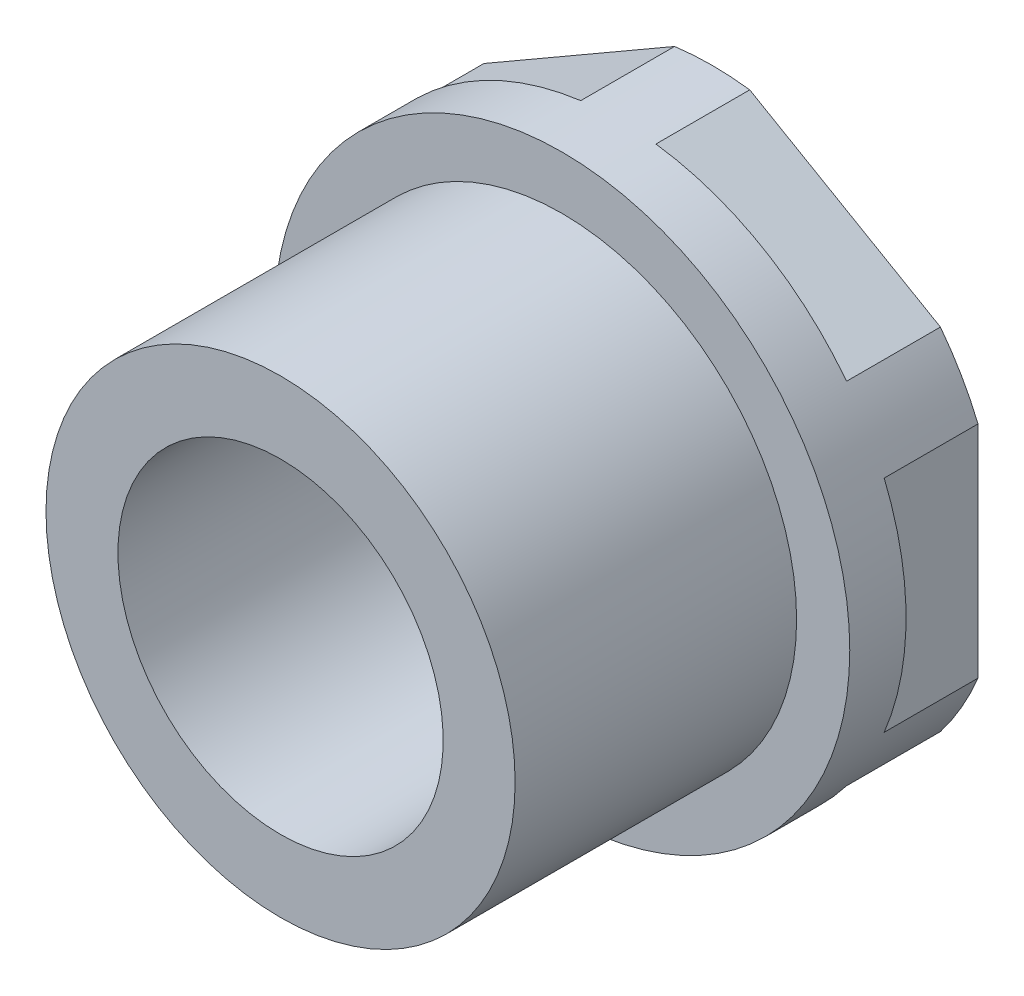
ISO-10303-21;
HEADER;
FILE_DESCRIPTION(('STEP AP214'),'2;1');
FILE_NAME('part.step','',(''),(''),'','','');
FILE_SCHEMA(('AUTOMOTIVE_DESIGN { 1 0 10303 214 1 1 1 1 }'));
ENDSEC;
DATA;
#1=APPLICATION_CONTEXT('core data for automotive mechanical design processes');
#2=APPLICATION_PROTOCOL_DEFINITION('international standard','automotive_design',2000,#1);
#3=PRODUCT_CONTEXT('',#1,'mechanical');
#4=PRODUCT('Part','Part','',(#3));
#5=PRODUCT_RELATED_PRODUCT_CATEGORY('part','',(#4));
#6=PRODUCT_DEFINITION_FORMATION('','',#4);
#7=PRODUCT_DEFINITION_CONTEXT('part definition',#1,'design');
#8=PRODUCT_DEFINITION('design','',#6,#7);
#9=PRODUCT_DEFINITION_SHAPE('','',#8);
#10=(LENGTH_UNIT() NAMED_UNIT(*) SI_UNIT(.MILLI.,.METRE.));
#11=(NAMED_UNIT(*) PLANE_ANGLE_UNIT() SI_UNIT($,.RADIAN.));
#12=(NAMED_UNIT(*) SI_UNIT($,.STERADIAN.) SOLID_ANGLE_UNIT());
#13=UNCERTAINTY_MEASURE_WITH_UNIT(LENGTH_MEASURE(1.E-05),#10,'distance_accuracy_value','');
#14=(GEOMETRIC_REPRESENTATION_CONTEXT(3) GLOBAL_UNCERTAINTY_ASSIGNED_CONTEXT((#13)) GLOBAL_UNIT_ASSIGNED_CONTEXT((#10,
#11,#12)) REPRESENTATION_CONTEXT('',''));
#15=CARTESIAN_POINT('',(0.,0.,0.));
#16=DIRECTION('',(0.,0.,1.));
#17=DIRECTION('',(1.,0.,0.));
#18=AXIS2_PLACEMENT_3D('',#15,#16,#17);
#19=CARTESIAN_POINT('',(-5.86105340387706,40.6504195270786,51.5));
#20=DIRECTION('',(0.,0.,-1.));
#21=DIRECTION('',(-1.,0.,0.));
#22=AXIS2_PLACEMENT_3D('',#19,#20,#21);
#23=PLANE('',#22);
#24=CARTESIAN_POINT('',(-5.86105340387706,40.6504195270786,51.5));
#25=DIRECTION('',(0.,0.,1.));
#26=DIRECTION('',(0.,-1.,0.));
#27=AXIS2_PLACEMENT_3D('',#24,#25,#26);
#28=CIRCLE('',#27,9.2);
#29=CARTESIAN_POINT('',(1.43730681105818,46.2516638685665,51.5));
#30=VERTEX_POINT('',#29);
#31=CARTESIAN_POINT('',(-4.65941361881229,49.7716070499261,51.5));
#32=VERTEX_POINT('',#31);
#33=EDGE_CURVE('E126',#30,#32,#28,.T.);
#34=ORIENTED_EDGE('',*,*,#33,.F.);
#35=DIRECTION('',(0.866025403784439,-0.5,0.));
#36=VECTOR('',#35,1.);
#37=CARTESIAN_POINT('',(-4.65941361881229,49.7716070499261,51.5));
#38=LINE('',#37,#36);
#39=EDGE_CURVE('E122',#30,#32,#38,.F.);
#40=ORIENTED_EDGE('',*,*,#39,.T.);
#41=EDGE_LOOP('',(#34,#40));
#42=FACE_BOUND('',#41,.T.);
#43=ADVANCED_FACE('F18',(#42),#23,.T.);
#44=CARTESIAN_POINT('',(-4.65941361881229,49.7716070499261,51.5));
#45=DIRECTION('',(-0.5,-0.866025403784439,0.));
#46=DIRECTION('',(0.866025403784439,-0.5,0.));
#47=AXIS2_PLACEMENT_3D('',#44,#45,#46);
#48=PLANE('',#47);
#49=ORIENTED_EDGE('',*,*,#39,.F.);
#50=DIRECTION('',(0.,0.,1.));
#51=VECTOR('',#50,1.);
#52=CARTESIAN_POINT('',(1.43730681105818,46.2516638685665,53.3));
#53=LINE('',#52,#51);
#54=CARTESIAN_POINT('',(1.43730681105818,46.2516638685665,48.5));
#55=VERTEX_POINT('',#54);
#56=EDGE_CURVE('E120',#55,#30,#53,.T.);
#57=ORIENTED_EDGE('',*,*,#56,.F.);
#58=DIRECTION('',(0.866025403784438,-0.5,0.));
#59=VECTOR('',#58,1.);
#60=CARTESIAN_POINT('',(-4.65941361881229,49.7716070499261,48.5));
#61=LINE('',#60,#59);
#62=CARTESIAN_POINT('',(-4.65941361881229,49.7716070499261,48.5));
#63=VERTEX_POINT('',#62);
#64=EDGE_CURVE('E105',#63,#55,#61,.T.);
#65=ORIENTED_EDGE('',*,*,#64,.F.);
#66=DIRECTION('',(0.,0.,1.));
#67=VECTOR('',#66,1.);
#68=CARTESIAN_POINT('',(-4.65941361881229,49.7716070499261,53.3));
#69=LINE('',#68,#67);
#70=EDGE_CURVE('E136',#32,#63,#69,.F.);
#71=ORIENTED_EDGE('',*,*,#70,.F.);
#72=EDGE_LOOP('',(#49,#57,#65,#71));
#73=FACE_BOUND('',#72,.T.);
#74=ADVANCED_FACE('F121',(#73),#48,.F.);
#75=CARTESIAN_POINT('',(-5.86105340387706,40.6504195270786,51.5));
#76=DIRECTION('',(0.,0.,-1.));
#77=DIRECTION('',(-1.,0.,0.));
#78=AXIS2_PLACEMENT_3D('',#75,#76,#77);
#79=PLANE('',#78);
#80=CARTESIAN_POINT('',(-5.86105340387706,40.6504195270786,51.5));
#81=DIRECTION('',(0.,0.,1.));
#82=DIRECTION('',(0.,-1.,0.));
#83=AXIS2_PLACEMENT_3D('',#80,#81,#82);
#84=CIRCLE('',#83,9.2);
#85=CARTESIAN_POINT('',(-7.06269318894182,49.7716070499261,51.5));
#86=VERTEX_POINT('',#85);
#87=CARTESIAN_POINT('',(-13.1594136188123,46.2516638685665,51.5));
#88=VERTEX_POINT('',#87);
#89=EDGE_CURVE('E139',#86,#88,#84,.T.);
#90=ORIENTED_EDGE('',*,*,#89,.F.);
#91=DIRECTION('',(0.866025403784439,0.5,0.));
#92=VECTOR('',#91,1.);
#93=CARTESIAN_POINT('',(-13.1594136188123,46.2516638685665,51.5));
#94=LINE('',#93,#92);
#95=EDGE_CURVE('E183',#86,#88,#94,.F.);
#96=ORIENTED_EDGE('',*,*,#95,.T.);
#97=EDGE_LOOP('',(#90,#96));
#98=FACE_BOUND('',#97,.T.);
#99=ADVANCED_FACE('F337',(#98),#79,.T.);
#100=CARTESIAN_POINT('',(-13.1594136188123,46.2516638685665,51.5));
#101=DIRECTION('',(0.5,-0.866025403784439,0.));
#102=DIRECTION('',(0.866025403784439,0.5,0.));
#103=AXIS2_PLACEMENT_3D('',#100,#101,#102);
#104=PLANE('',#103);
#105=ORIENTED_EDGE('',*,*,#95,.F.);
#106=DIRECTION('',(0.,0.,1.));
#107=VECTOR('',#106,1.);
#108=CARTESIAN_POINT('',(-7.06269318894182,49.7716070499261,53.3));
#109=LINE('',#108,#107);
#110=CARTESIAN_POINT('',(-7.06269318894182,49.7716070499261,48.5));
#111=VERTEX_POINT('',#110);
#112=EDGE_CURVE('E138',#111,#86,#109,.T.);
#113=ORIENTED_EDGE('',*,*,#112,.F.);
#114=DIRECTION('',(0.866025403784439,0.5,0.));
#115=VECTOR('',#114,1.);
#116=CARTESIAN_POINT('',(-13.1594136188123,46.2516638685665,48.5));
#117=LINE('',#116,#115);
#118=CARTESIAN_POINT('',(-13.1594136188123,46.2516638685665,48.5));
#119=VERTEX_POINT('',#118);
#120=EDGE_CURVE('E117',#119,#111,#117,.T.);
#121=ORIENTED_EDGE('',*,*,#120,.F.);
#122=DIRECTION('',(0.,0.,1.));
#123=VECTOR('',#122,1.);
#124=CARTESIAN_POINT('',(-13.1594136188123,46.2516638685665,53.3));
#125=LINE('',#124,#123);
#126=EDGE_CURVE('E142',#88,#119,#125,.F.);
#127=ORIENTED_EDGE('',*,*,#126,.F.);
#128=EDGE_LOOP('',(#105,#113,#121,#127));
#129=FACE_BOUND('',#128,.T.);
#130=ADVANCED_FACE('F329',(#129),#104,.F.);
#131=CARTESIAN_POINT('',(-5.86105340387706,40.6504195270786,51.5));
#132=DIRECTION('',(0.,0.,-1.));
#133=DIRECTION('',(-1.,0.,0.));
#134=AXIS2_PLACEMENT_3D('',#131,#132,#133);
#135=PLANE('',#134);
#136=DIRECTION('',(0.,1.,0.));
#137=VECTOR('',#136,1.);
#138=CARTESIAN_POINT('',(-14.3610534038771,37.130476345719,51.5));
#139=LINE('',#138,#137);
#140=CARTESIAN_POINT('',(-14.3610534038771,44.1703627084382,51.5));
#141=VERTEX_POINT('',#140);
#142=CARTESIAN_POINT('',(-14.3610534038771,37.130476345719,51.5));
#143=VERTEX_POINT('',#142);
#144=EDGE_CURVE('E188',#141,#143,#139,.F.);
#145=ORIENTED_EDGE('',*,*,#144,.T.);
#146=CARTESIAN_POINT('',(-5.86105340387706,40.6504195270786,51.5));
#147=DIRECTION('',(0.,0.,1.));
#148=DIRECTION('',(0.,-1.,0.));
#149=AXIS2_PLACEMENT_3D('',#146,#147,#148);
#150=CIRCLE('',#149,9.2);
#151=EDGE_CURVE('E147',#141,#143,#150,.T.);
#152=ORIENTED_EDGE('',*,*,#151,.F.);
#153=EDGE_LOOP('',(#145,#152));
#154=FACE_BOUND('',#153,.T.);
#155=ADVANCED_FACE('F324',(#154),#135,.T.);
#156=CARTESIAN_POINT('',(-14.3610534038771,37.130476345719,51.5));
#157=DIRECTION('',(1.,0.,0.));
#158=DIRECTION('',(0.,1.,0.));
#159=AXIS2_PLACEMENT_3D('',#156,#157,#158);
#160=PLANE('',#159);
#161=ORIENTED_EDGE('',*,*,#144,.F.);
#162=DIRECTION('',(0.,0.,1.));
#163=VECTOR('',#162,1.);
#164=CARTESIAN_POINT('',(-14.3610534038771,44.1703627084382,53.3));
#165=LINE('',#164,#163);
#166=CARTESIAN_POINT('',(-14.3610534038771,44.1703627084382,48.5));
#167=VERTEX_POINT('',#166);
#168=EDGE_CURVE('E146',#167,#141,#165,.T.);
#169=ORIENTED_EDGE('',*,*,#168,.F.);
#170=DIRECTION('',(0.,1.,0.));
#171=VECTOR('',#170,1.);
#172=CARTESIAN_POINT('',(-14.3610534038771,40.6504195270786,48.5));
#173=LINE('',#172,#171);
#174=CARTESIAN_POINT('',(-14.3610534038771,37.130476345719,48.5));
#175=VERTEX_POINT('',#174);
#176=EDGE_CURVE('E211',#175,#167,#173,.T.);
#177=ORIENTED_EDGE('',*,*,#176,.F.);
#178=DIRECTION('',(0.,0.,1.));
#179=VECTOR('',#178,1.);
#180=CARTESIAN_POINT('',(-14.3610534038771,37.130476345719,53.3));
#181=LINE('',#180,#179);
#182=EDGE_CURVE('E150',#143,#175,#181,.F.);
#183=ORIENTED_EDGE('',*,*,#182,.F.);
#184=EDGE_LOOP('',(#161,#169,#177,#183));
#185=FACE_BOUND('',#184,.T.);
#186=ADVANCED_FACE('F316',(#185),#160,.F.);
#187=CARTESIAN_POINT('',(-5.86105340387706,40.6504195270786,51.5));
#188=DIRECTION('',(0.,0.,-1.));
#189=DIRECTION('',(-1.,0.,0.));
#190=AXIS2_PLACEMENT_3D('',#187,#188,#189);
#191=PLANE('',#190);
#192=CARTESIAN_POINT('',(-5.86105340387706,40.6504195270786,51.5));
#193=DIRECTION('',(0.,0.,1.));
#194=DIRECTION('',(0.,-1.,0.));
#195=AXIS2_PLACEMENT_3D('',#192,#193,#194);
#196=CIRCLE('',#195,9.2);
#197=CARTESIAN_POINT('',(-13.1594136188123,35.0491751855907,51.5));
#198=VERTEX_POINT('',#197);
#199=CARTESIAN_POINT('',(-7.06269318894182,31.529232004231,51.5));
#200=VERTEX_POINT('',#199);
#201=EDGE_CURVE('E155',#198,#200,#196,.T.);
#202=ORIENTED_EDGE('',*,*,#201,.F.);
#203=DIRECTION('',(-0.866025403784439,0.5,0.));
#204=VECTOR('',#203,1.);
#205=CARTESIAN_POINT('',(-7.06269318894183,31.529232004231,51.5));
#206=LINE('',#205,#204);
#207=EDGE_CURVE('E193',#198,#200,#206,.F.);
#208=ORIENTED_EDGE('',*,*,#207,.T.);
#209=EDGE_LOOP('',(#202,#208));
#210=FACE_BOUND('',#209,.T.);
#211=ADVANCED_FACE('F311',(#210),#191,.T.);
#212=CARTESIAN_POINT('',(-7.06269318894183,31.529232004231,51.5));
#213=DIRECTION('',(0.5,0.866025403784439,0.));
#214=DIRECTION('',(-0.866025403784439,0.5,0.));
#215=AXIS2_PLACEMENT_3D('',#212,#213,#214);
#216=PLANE('',#215);
#217=ORIENTED_EDGE('',*,*,#207,.F.);
#218=DIRECTION('',(0.,0.,1.));
#219=VECTOR('',#218,1.);
#220=CARTESIAN_POINT('',(-13.1594136188123,35.0491751855906,53.3));
#221=LINE('',#220,#219);
#222=CARTESIAN_POINT('',(-13.1594136188123,35.0491751855906,48.5));
#223=VERTEX_POINT('',#222);
#224=EDGE_CURVE('E154',#223,#198,#221,.T.);
#225=ORIENTED_EDGE('',*,*,#224,.F.);
#226=DIRECTION('',(-0.866025403784439,0.499999999999999,0.));
#227=VECTOR('',#226,1.);
#228=CARTESIAN_POINT('',(-7.06269318894182,31.529232004231,48.5));
#229=LINE('',#228,#227);
#230=CARTESIAN_POINT('',(-7.06269318894182,31.529232004231,48.5));
#231=VERTEX_POINT('',#230);
#232=EDGE_CURVE('E209',#231,#223,#229,.T.);
#233=ORIENTED_EDGE('',*,*,#232,.F.);
#234=DIRECTION('',(0.,0.,1.));
#235=VECTOR('',#234,1.);
#236=CARTESIAN_POINT('',(-7.06269318894182,31.529232004231,53.3));
#237=LINE('',#236,#235);
#238=EDGE_CURVE('E158',#200,#231,#237,.F.);
#239=ORIENTED_EDGE('',*,*,#238,.F.);
#240=EDGE_LOOP('',(#217,#225,#233,#239));
#241=FACE_BOUND('',#240,.T.);
#242=ADVANCED_FACE('F301',(#241),#216,.F.);
#243=CARTESIAN_POINT('',(-5.86105340387706,40.6504195270786,51.5));
#244=DIRECTION('',(0.,0.,-1.));
#245=DIRECTION('',(-1.,0.,0.));
#246=AXIS2_PLACEMENT_3D('',#243,#244,#245);
#247=PLANE('',#246);
#248=CARTESIAN_POINT('',(-5.86105340387706,40.6504195270786,51.5));
#249=DIRECTION('',(0.,0.,1.));
#250=DIRECTION('',(0.,-1.,0.));
#251=AXIS2_PLACEMENT_3D('',#248,#249,#250);
#252=CIRCLE('',#251,9.2);
#253=CARTESIAN_POINT('',(-4.65941361881228,31.529232004231,51.5));
#254=VERTEX_POINT('',#253);
#255=CARTESIAN_POINT('',(1.43730681105818,35.0491751855906,51.5));
#256=VERTEX_POINT('',#255);
#257=EDGE_CURVE('E163',#254,#256,#252,.T.);
#258=ORIENTED_EDGE('',*,*,#257,.F.);
#259=DIRECTION('',(-0.866025403784438,-0.500000000000001,0.));
#260=VECTOR('',#259,1.);
#261=CARTESIAN_POINT('',(1.43730681105818,35.0491751855906,51.5));
#262=LINE('',#261,#260);
#263=EDGE_CURVE('E199',#254,#256,#262,.F.);
#264=ORIENTED_EDGE('',*,*,#263,.T.);
#265=EDGE_LOOP('',(#258,#264));
#266=FACE_BOUND('',#265,.T.);
#267=ADVANCED_FACE('F295',(#266),#247,.T.);
#268=CARTESIAN_POINT('',(1.43730681105818,35.0491751855906,51.5));
#269=DIRECTION('',(-0.500000000000001,0.866025403784438,0.));
#270=DIRECTION('',(-0.866025403784438,-0.500000000000001,0.));
#271=AXIS2_PLACEMENT_3D('',#268,#269,#270);
#272=PLANE('',#271);
#273=ORIENTED_EDGE('',*,*,#263,.F.);
#274=DIRECTION('',(0.,0.,1.));
#275=VECTOR('',#274,1.);
#276=CARTESIAN_POINT('',(-4.65941361881228,31.529232004231,53.3));
#277=LINE('',#276,#275);
#278=CARTESIAN_POINT('',(-4.65941361881229,31.529232004231,48.5));
#279=VERTEX_POINT('',#278);
#280=EDGE_CURVE('E162',#279,#254,#277,.T.);
#281=ORIENTED_EDGE('',*,*,#280,.F.);
#282=DIRECTION('',(-0.866025403784438,-0.5,0.));
#283=VECTOR('',#282,1.);
#284=CARTESIAN_POINT('',(1.43730681105818,35.0491751855906,48.5));
#285=LINE('',#284,#283);
#286=CARTESIAN_POINT('',(1.43730681105818,35.0491751855906,48.5));
#287=VERTEX_POINT('',#286);
#288=EDGE_CURVE('E205',#287,#279,#285,.T.);
#289=ORIENTED_EDGE('',*,*,#288,.F.);
#290=DIRECTION('',(0.,0.,1.));
#291=VECTOR('',#290,1.);
#292=CARTESIAN_POINT('',(1.43730681105818,35.0491751855906,53.3));
#293=LINE('',#292,#291);
#294=EDGE_CURVE('E166',#256,#287,#293,.F.);
#295=ORIENTED_EDGE('',*,*,#294,.F.);
#296=EDGE_LOOP('',(#273,#281,#289,#295));
#297=FACE_BOUND('',#296,.T.);
#298=ADVANCED_FACE('F300',(#297),#272,.F.);
#299=CARTESIAN_POINT('',(-5.86105340387706,40.6504195270786,48.5));
#300=DIRECTION('',(0.,0.,-1.));
#301=DIRECTION('',(-1.,0.,0.));
#302=AXIS2_PLACEMENT_3D('',#299,#300,#301);
#303=PLANE('',#302);
#304=CARTESIAN_POINT('',(-5.86105340387706,40.6504195270786,48.4999999999332));
#305=DIRECTION('',(0.,0.,-1.));
#306=DIRECTION('',(0.,1.,0.));
#307=AXIS2_PLACEMENT_3D('',#304,#305,#306);
#308=CIRCLE('',#307,6.19999999994332);
#309=CARTESIAN_POINT('',(-5.86105340387706,46.8504195270219,48.4999999999332));
#310=VERTEX_POINT('',#309);
#311=EDGE_CURVE('E21',#310,#310,#308,.F.);
#312=ORIENTED_EDGE('',*,*,#311,.T.);
#313=EDGE_LOOP('',(#312));
#314=FACE_BOUND('',#313,.T.);
#315=ORIENTED_EDGE('',*,*,#64,.T.);
#316=CARTESIAN_POINT('',(-5.86105340387706,40.6504195270786,48.5));
#317=DIRECTION('',(0.,0.,1.));
#318=DIRECTION('',(0.,-1.,0.));
#319=AXIS2_PLACEMENT_3D('',#316,#317,#318);
#320=CIRCLE('',#319,9.2);
#321=CARTESIAN_POINT('',(2.63894659612294,44.1703627084382,48.5));
#322=VERTEX_POINT('',#321);
#323=EDGE_CURVE('E109',#322,#55,#320,.T.);
#324=ORIENTED_EDGE('',*,*,#323,.F.);
#325=DIRECTION('',(0.,-1.,0.));
#326=VECTOR('',#325,1.);
#327=CARTESIAN_POINT('',(2.63894659612294,44.1703627084382,48.5));
#328=LINE('',#327,#326);
#329=CARTESIAN_POINT('',(2.63894659612294,37.130476345719,48.5));
#330=VERTEX_POINT('',#329);
#331=EDGE_CURVE('E116',#322,#330,#328,.T.);
#332=ORIENTED_EDGE('',*,*,#331,.T.);
#333=CARTESIAN_POINT('',(-5.86105340387706,40.6504195270786,48.5));
#334=DIRECTION('',(0.,0.,1.));
#335=DIRECTION('',(0.,-1.,0.));
#336=AXIS2_PLACEMENT_3D('',#333,#334,#335);
#337=CIRCLE('',#336,9.2);
#338=EDGE_CURVE('E167',#287,#330,#337,.T.);
#339=ORIENTED_EDGE('',*,*,#338,.F.);
#340=ORIENTED_EDGE('',*,*,#288,.T.);
#341=CARTESIAN_POINT('',(-5.86105340387706,40.6504195270786,48.5));
#342=DIRECTION('',(0.,0.,1.));
#343=DIRECTION('',(0.,-1.,0.));
#344=AXIS2_PLACEMENT_3D('',#341,#342,#343);
#345=CIRCLE('',#344,9.2);
#346=EDGE_CURVE('E159',#231,#279,#345,.T.);
#347=ORIENTED_EDGE('',*,*,#346,.F.);
#348=ORIENTED_EDGE('',*,*,#232,.T.);
#349=CARTESIAN_POINT('',(-5.86105340387706,40.6504195270786,48.5));
#350=DIRECTION('',(0.,0.,1.));
#351=DIRECTION('',(0.,-1.,0.));
#352=AXIS2_PLACEMENT_3D('',#349,#350,#351);
#353=CIRCLE('',#352,9.2);
#354=EDGE_CURVE('E151',#175,#223,#353,.T.);
#355=ORIENTED_EDGE('',*,*,#354,.F.);
#356=ORIENTED_EDGE('',*,*,#176,.T.);
#357=CARTESIAN_POINT('',(-5.86105340387706,40.6504195270786,48.5));
#358=DIRECTION('',(0.,0.,1.));
#359=DIRECTION('',(0.,-1.,0.));
#360=AXIS2_PLACEMENT_3D('',#357,#358,#359);
#361=CIRCLE('',#360,9.2);
#362=EDGE_CURVE('E143',#119,#167,#361,.T.);
#363=ORIENTED_EDGE('',*,*,#362,.F.);
#364=ORIENTED_EDGE('',*,*,#120,.T.);
#365=CARTESIAN_POINT('',(-5.86105340387706,40.6504195270786,48.5));
#366=DIRECTION('',(0.,0.,1.));
#367=DIRECTION('',(0.,-1.,0.));
#368=AXIS2_PLACEMENT_3D('',#365,#366,#367);
#369=CIRCLE('',#368,9.2);
#370=EDGE_CURVE('E112',#63,#111,#369,.T.);
#371=ORIENTED_EDGE('',*,*,#370,.F.);
#372=EDGE_LOOP('',(#315,#324,#332,#339,#340,#347,#348,#355,#356,#363,#364,#371));
#373=FACE_BOUND('',#372,.T.);
#374=ADVANCED_FACE('F107',(#314,#373),#303,.T.);
#375=CARTESIAN_POINT('',(2.63894659612294,44.1703627084382,51.5));
#376=DIRECTION('',(-1.,0.,0.));
#377=DIRECTION('',(0.,-1.,0.));
#378=AXIS2_PLACEMENT_3D('',#375,#376,#377);
#379=PLANE('',#378);
#380=DIRECTION('',(0.,1.,0.));
#381=VECTOR('',#380,1.);
#382=CARTESIAN_POINT('',(2.63894659612295,40.6504195270786,51.5));
#383=LINE('',#382,#381);
#384=CARTESIAN_POINT('',(2.63894659612295,37.130476345719,51.5));
#385=VERTEX_POINT('',#384);
#386=CARTESIAN_POINT('',(2.63894659612294,44.1703627084382,51.5));
#387=VERTEX_POINT('',#386);
#388=EDGE_CURVE('E36',#385,#387,#383,.T.);
#389=ORIENTED_EDGE('',*,*,#388,.F.);
#390=DIRECTION('',(0.,0.,1.));
#391=VECTOR('',#390,1.);
#392=CARTESIAN_POINT('',(2.63894659612295,37.130476345719,53.3));
#393=LINE('',#392,#391);
#394=EDGE_CURVE('E170',#330,#385,#393,.T.);
#395=ORIENTED_EDGE('',*,*,#394,.F.);
#396=ORIENTED_EDGE('',*,*,#331,.F.);
#397=DIRECTION('',(0.,0.,1.));
#398=VECTOR('',#397,1.);
#399=CARTESIAN_POINT('',(2.63894659612294,44.1703627084382,53.3));
#400=LINE('',#399,#398);
#401=EDGE_CURVE('E132',#387,#322,#400,.F.);
#402=ORIENTED_EDGE('',*,*,#401,.F.);
#403=EDGE_LOOP('',(#389,#395,#396,#402));
#404=FACE_BOUND('',#403,.T.);
#405=ADVANCED_FACE('F287',(#404),#379,.F.);
#406=CARTESIAN_POINT('',(-5.86105340387706,40.6504195270786,51.5));
#407=DIRECTION('',(0.,0.,-1.));
#408=DIRECTION('',(-1.,0.,0.));
#409=AXIS2_PLACEMENT_3D('',#406,#407,#408);
#410=PLANE('',#409);
#411=ORIENTED_EDGE('',*,*,#388,.T.);
#412=CARTESIAN_POINT('',(-5.86105340387706,40.6504195270786,51.5));
#413=DIRECTION('',(0.,0.,1.));
#414=DIRECTION('',(0.,-1.,0.));
#415=AXIS2_PLACEMENT_3D('',#412,#413,#414);
#416=CIRCLE('',#415,9.2);
#417=EDGE_CURVE('E171',#385,#387,#416,.T.);
#418=ORIENTED_EDGE('',*,*,#417,.F.);
#419=EDGE_LOOP('',(#411,#418));
#420=FACE_BOUND('',#419,.T.);
#421=ADVANCED_FACE('F278',(#420),#410,.T.);
#422=CARTESIAN_POINT('',(-5.86105340387706,40.6504195270786,48.4999999999332));
#423=DIRECTION('',(0.,0.,-1.));
#424=DIRECTION('',(0.,1.,0.));
#425=AXIS2_PLACEMENT_3D('',#422,#423,#424);
#426=CONICAL_SURFACE('',#425,6.19999999994332,0.785398163366535);
#427=CARTESIAN_POINT('',(-5.86105340387706,40.6504195270786,49.5));
#428=DIRECTION('',(0.,0.,1.));
#429=DIRECTION('',(0.,-1.,0.));
#430=AXIS2_PLACEMENT_3D('',#427,#428,#429);
#431=CIRCLE('',#430,5.2);
#432=CARTESIAN_POINT('',(-5.86105340387706,35.4504195270786,49.5));
#433=VERTEX_POINT('',#432);
#434=EDGE_CURVE('E173',#433,#433,#431,.T.);
#435=ORIENTED_EDGE('',*,*,#434,.T.);
#436=EDGE_LOOP('',(#435));
#437=FACE_BOUND('',#436,.T.);
#438=ORIENTED_EDGE('',*,*,#311,.F.);
#439=EDGE_LOOP('',(#438));
#440=FACE_BOUND('',#439,.T.);
#441=ADVANCED_FACE('F221',(#437,#440),#426,.F.);
#442=CARTESIAN_POINT('',(-5.86105340387706,40.6504195270786,53.3));
#443=DIRECTION('',(0.,0.,1.));
#444=DIRECTION('',(0.,-1.,0.));
#445=AXIS2_PLACEMENT_3D('',#442,#443,#444);
#446=CYLINDRICAL_SURFACE('',#445,9.2);
#447=ORIENTED_EDGE('',*,*,#168,.T.);
#448=ORIENTED_EDGE('',*,*,#151,.T.);
#449=ORIENTED_EDGE('',*,*,#182,.T.);
#450=ORIENTED_EDGE('',*,*,#354,.T.);
#451=ORIENTED_EDGE('',*,*,#224,.T.);
#452=ORIENTED_EDGE('',*,*,#201,.T.);
#453=ORIENTED_EDGE('',*,*,#238,.T.);
#454=ORIENTED_EDGE('',*,*,#346,.T.);
#455=ORIENTED_EDGE('',*,*,#280,.T.);
#456=ORIENTED_EDGE('',*,*,#257,.T.);
#457=ORIENTED_EDGE('',*,*,#294,.T.);
#458=ORIENTED_EDGE('',*,*,#338,.T.);
#459=ORIENTED_EDGE('',*,*,#394,.T.);
#460=ORIENTED_EDGE('',*,*,#417,.T.);
#461=ORIENTED_EDGE('',*,*,#401,.T.);
#462=ORIENTED_EDGE('',*,*,#323,.T.);
#463=ORIENTED_EDGE('',*,*,#56,.T.);
#464=ORIENTED_EDGE('',*,*,#33,.T.);
#465=ORIENTED_EDGE('',*,*,#70,.T.);
#466=ORIENTED_EDGE('',*,*,#370,.T.);
#467=ORIENTED_EDGE('',*,*,#112,.T.);
#468=ORIENTED_EDGE('',*,*,#89,.T.);
#469=ORIENTED_EDGE('',*,*,#126,.T.);
#470=ORIENTED_EDGE('',*,*,#362,.T.);
#471=EDGE_LOOP('',(#447,#448,#449,#450,#451,#452,#453,#454,#455,#456,#457,#458,#459,#460,#461,
#462,#463,#464,#465,#466,#467,#468,#469,#470));
#472=FACE_BOUND('',#471,.T.);
#473=CARTESIAN_POINT('',(-5.86105340387706,40.6504195270786,53.3));
#474=DIRECTION('',(0.,0.,1.));
#475=DIRECTION('',(0.,-1.,0.));
#476=AXIS2_PLACEMENT_3D('',#473,#474,#475);
#477=CIRCLE('',#476,9.2);
#478=CARTESIAN_POINT('',(-5.86105340387706,31.4504195270786,53.3));
#479=VERTEX_POINT('',#478);
#480=EDGE_CURVE('E174',#479,#479,#477,.F.);
#481=ORIENTED_EDGE('',*,*,#480,.T.);
#482=EDGE_LOOP('',(#481));
#483=FACE_BOUND('',#482,.T.);
#484=ADVANCED_FACE('F129',(#472,#483),#446,.T.);
#485=CARTESIAN_POINT('',(-5.86105340387706,40.6504195270786,53.3));
#486=DIRECTION('',(0.,0.,1.));
#487=DIRECTION('',(0.,-1.,0.));
#488=AXIS2_PLACEMENT_3D('',#485,#486,#487);
#489=CYLINDRICAL_SURFACE('',#488,5.2);
#490=CARTESIAN_POINT('',(-5.86105340387706,40.6504195270786,62.3));
#491=DIRECTION('',(0.,0.,1.));
#492=DIRECTION('',(0.,-1.,0.));
#493=AXIS2_PLACEMENT_3D('',#490,#491,#492);
#494=CIRCLE('',#493,5.2);
#495=CARTESIAN_POINT('',(-5.86105340387706,35.4504195270786,62.3));
#496=VERTEX_POINT('',#495);
#497=EDGE_CURVE('E177',#496,#496,#494,.F.);
#498=ORIENTED_EDGE('',*,*,#497,.F.);
#499=EDGE_LOOP('',(#498));
#500=FACE_BOUND('',#499,.T.);
#501=ORIENTED_EDGE('',*,*,#434,.F.);
#502=EDGE_LOOP('',(#501));
#503=FACE_BOUND('',#502,.T.);
#504=ADVANCED_FACE('F224',(#500,#503),#489,.F.);
#505=CARTESIAN_POINT('',(-5.86105340387706,40.6504195270786,53.3));
#506=DIRECTION('',(0.,0.,-1.));
#507=DIRECTION('',(-1.,0.,0.));
#508=AXIS2_PLACEMENT_3D('',#505,#506,#507);
#509=PLANE('',#508);
#510=CARTESIAN_POINT('',(-5.86105340387706,40.6504195270786,53.3));
#511=DIRECTION('',(0.,0.,1.));
#512=DIRECTION('',(0.,-1.,0.));
#513=AXIS2_PLACEMENT_3D('',#510,#511,#512);
#514=CIRCLE('',#513,7.5);
#515=CARTESIAN_POINT('',(-5.86105340387706,33.1504195270786,53.3));
#516=VERTEX_POINT('',#515);
#517=EDGE_CURVE('E27',#516,#516,#514,.T.);
#518=ORIENTED_EDGE('',*,*,#517,.F.);
#519=EDGE_LOOP('',(#518));
#520=FACE_BOUND('',#519,.T.);
#521=ORIENTED_EDGE('',*,*,#480,.F.);
#522=EDGE_LOOP('',(#521));
#523=FACE_BOUND('',#522,.T.);
#524=ADVANCED_FACE('F226',(#520,#523),#509,.F.);
#525=CARTESIAN_POINT('',(-5.86105340387706,40.6504195270786,62.3));
#526=DIRECTION('',(0.,0.,1.));
#527=DIRECTION('',(0.,-1.,0.));
#528=AXIS2_PLACEMENT_3D('',#525,#526,#527);
#529=PLANE('',#528);
#530=ORIENTED_EDGE('',*,*,#497,.T.);
#531=EDGE_LOOP('',(#530));
#532=FACE_BOUND('',#531,.T.);
#533=CARTESIAN_POINT('',(-5.86105340387706,40.6504195270786,62.3));
#534=DIRECTION('',(0.,0.,1.));
#535=DIRECTION('',(0.,-1.,0.));
#536=AXIS2_PLACEMENT_3D('',#533,#534,#535);
#537=CIRCLE('',#536,7.5);
#538=CARTESIAN_POINT('',(-5.86105340387706,33.1504195270786,62.3));
#539=VERTEX_POINT('',#538);
#540=EDGE_CURVE('E11',#539,#539,#537,.F.);
#541=ORIENTED_EDGE('',*,*,#540,.F.);
#542=EDGE_LOOP('',(#541));
#543=FACE_BOUND('',#542,.T.);
#544=ADVANCED_FACE('F234',(#532,#543),#529,.T.);
#545=CARTESIAN_POINT('',(-5.86105340387706,40.6504195270786,62.3));
#546=DIRECTION('',(0.,0.,1.));
#547=DIRECTION('',(0.,-1.,0.));
#548=AXIS2_PLACEMENT_3D('',#545,#546,#547);
#549=CYLINDRICAL_SURFACE('',#548,7.5);
#550=ORIENTED_EDGE('',*,*,#517,.T.);
#551=EDGE_LOOP('',(#550));
#552=FACE_BOUND('',#551,.T.);
#553=ORIENTED_EDGE('',*,*,#540,.T.);
#554=EDGE_LOOP('',(#553));
#555=FACE_BOUND('',#554,.T.);
#556=ADVANCED_FACE('F239',(#552,#555),#549,.T.);
#557=CLOSED_SHELL('',(#43,#74,#99,#130,#155,#186,#211,#242,#267,#298,#374,#405,#421,#441,#484,
#504,#524,#544,#556));
#558=MANIFOLD_SOLID_BREP('B1',#557);
#559=ADVANCED_BREP_SHAPE_REPRESENTATION('',(#18,#558),#14);
#560=SHAPE_DEFINITION_REPRESENTATION(#9,#559);
ENDSEC;
END-ISO-10303-21;
